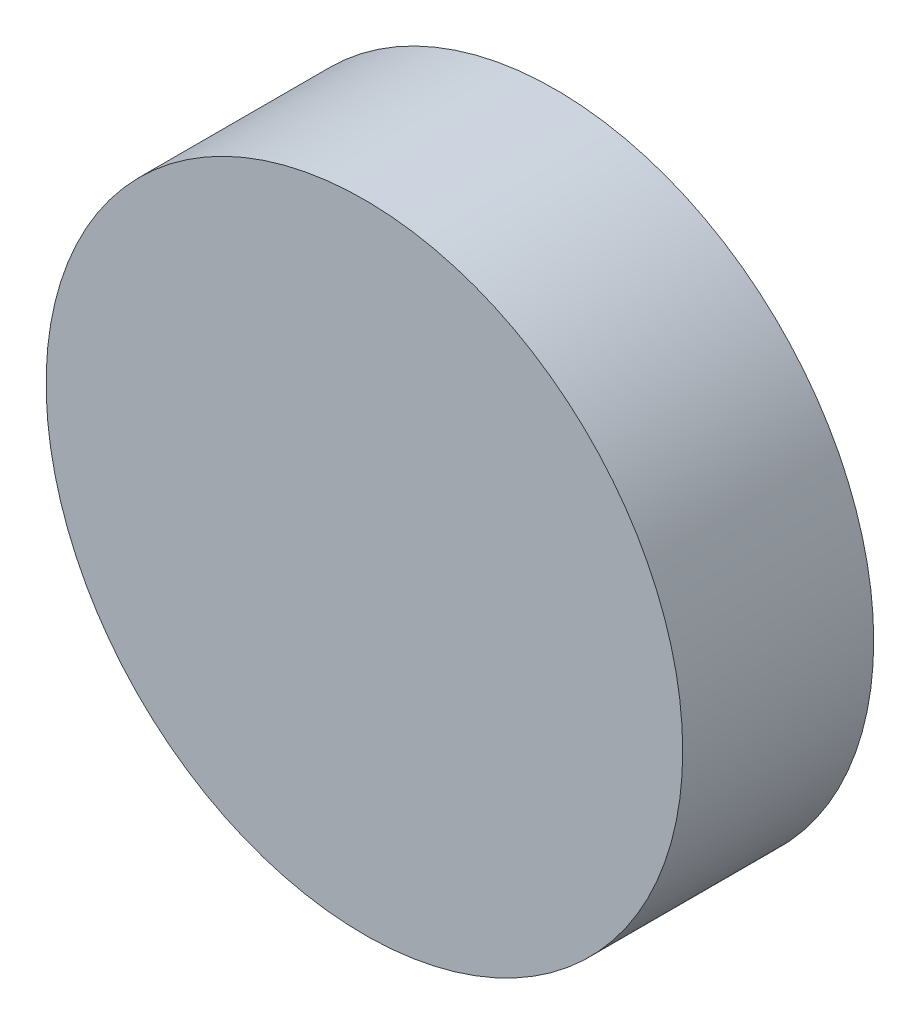
ISO-10303-21;
HEADER;
FILE_DESCRIPTION(('STEP AP214'),'2;1');
FILE_NAME('part.step','',(''),(''),'','','');
FILE_SCHEMA(('AUTOMOTIVE_DESIGN { 1 0 10303 214 1 1 1 1 }'));
ENDSEC;
DATA;
#1=APPLICATION_CONTEXT('core data for automotive mechanical design processes');
#2=APPLICATION_PROTOCOL_DEFINITION('international standard','automotive_design',2000,#1);
#3=PRODUCT_CONTEXT('',#1,'mechanical');
#4=PRODUCT('Part','Part','',(#3));
#5=PRODUCT_RELATED_PRODUCT_CATEGORY('part','',(#4));
#6=PRODUCT_DEFINITION_FORMATION('','',#4);
#7=PRODUCT_DEFINITION_CONTEXT('part definition',#1,'design');
#8=PRODUCT_DEFINITION('design','',#6,#7);
#9=PRODUCT_DEFINITION_SHAPE('','',#8);
#10=(LENGTH_UNIT() NAMED_UNIT(*) SI_UNIT(.MILLI.,.METRE.));
#11=(NAMED_UNIT(*) PLANE_ANGLE_UNIT() SI_UNIT($,.RADIAN.));
#12=(NAMED_UNIT(*) SI_UNIT($,.STERADIAN.) SOLID_ANGLE_UNIT());
#13=UNCERTAINTY_MEASURE_WITH_UNIT(LENGTH_MEASURE(1.E-05),#10,'distance_accuracy_value','');
#14=(GEOMETRIC_REPRESENTATION_CONTEXT(3) GLOBAL_UNCERTAINTY_ASSIGNED_CONTEXT((#13)) GLOBAL_UNIT_ASSIGNED_CONTEXT((#10,
#11,#12)) REPRESENTATION_CONTEXT('',''));
#15=CARTESIAN_POINT('',(0.,0.,0.));
#16=DIRECTION('',(0.,0.,1.));
#17=DIRECTION('',(1.,0.,0.));
#18=AXIS2_PLACEMENT_3D('',#15,#16,#17);
#19=CARTESIAN_POINT('',(0.,0.,60.));
#20=DIRECTION('',(0.,0.,-1.));
#21=DIRECTION('',(-1.,0.,0.));
#22=AXIS2_PLACEMENT_3D('',#19,#20,#21);
#23=CYLINDRICAL_SURFACE('',#22,100.);
#24=CARTESIAN_POINT('',(0.,0.,60.));
#25=DIRECTION('',(0.,0.,1.));
#26=DIRECTION('',(1.,0.,0.));
#27=AXIS2_PLACEMENT_3D('',#24,#25,#26);
#28=CIRCLE('',#27,100.);
#29=CARTESIAN_POINT('',(100.,0.,60.));
#30=VERTEX_POINT('',#29);
#31=EDGE_CURVE('E10',#30,#30,#28,.T.);
#32=ORIENTED_EDGE('',*,*,#31,.F.);
#33=EDGE_LOOP('',(#32));
#34=FACE_BOUND('',#33,.T.);
#35=CARTESIAN_POINT('',(0.,0.,0.));
#36=DIRECTION('',(0.,0.,1.));
#37=DIRECTION('',(1.,0.,0.));
#38=AXIS2_PLACEMENT_3D('',#35,#36,#37);
#39=CIRCLE('',#38,100.);
#40=CARTESIAN_POINT('',(100.,0.,0.));
#41=VERTEX_POINT('',#40);
#42=EDGE_CURVE('E34',#41,#41,#39,.T.);
#43=ORIENTED_EDGE('',*,*,#42,.T.);
#44=EDGE_LOOP('',(#43));
#45=FACE_BOUND('',#44,.T.);
#46=ADVANCED_FACE('F31',(#34,#45),#23,.T.);
#47=CARTESIAN_POINT('',(0.,0.,60.));
#48=DIRECTION('',(0.,0.,1.));
#49=DIRECTION('',(1.,0.,0.));
#50=AXIS2_PLACEMENT_3D('',#47,#48,#49);
#51=PLANE('',#50);
#52=ORIENTED_EDGE('',*,*,#31,.T.);
#53=EDGE_LOOP('',(#52));
#54=FACE_BOUND('',#53,.T.);
#55=ADVANCED_FACE('F46',(#54),#51,.T.);
#56=CARTESIAN_POINT('',(0.,0.,0.));
#57=DIRECTION('',(0.,0.,1.));
#58=DIRECTION('',(1.,0.,0.));
#59=AXIS2_PLACEMENT_3D('',#56,#57,#58);
#60=PLANE('',#59);
#61=ORIENTED_EDGE('',*,*,#42,.F.);
#62=EDGE_LOOP('',(#61));
#63=FACE_BOUND('',#62,.T.);
#64=ADVANCED_FACE('F44',(#63),#60,.F.);
#65=CLOSED_SHELL('',(#46,#55,#64));
#66=MANIFOLD_SOLID_BREP('B2',#65);
#67=ADVANCED_BREP_SHAPE_REPRESENTATION('',(#18,#66),#14);
#68=SHAPE_DEFINITION_REPRESENTATION(#9,#67);
ENDSEC;
END-ISO-10303-21;
